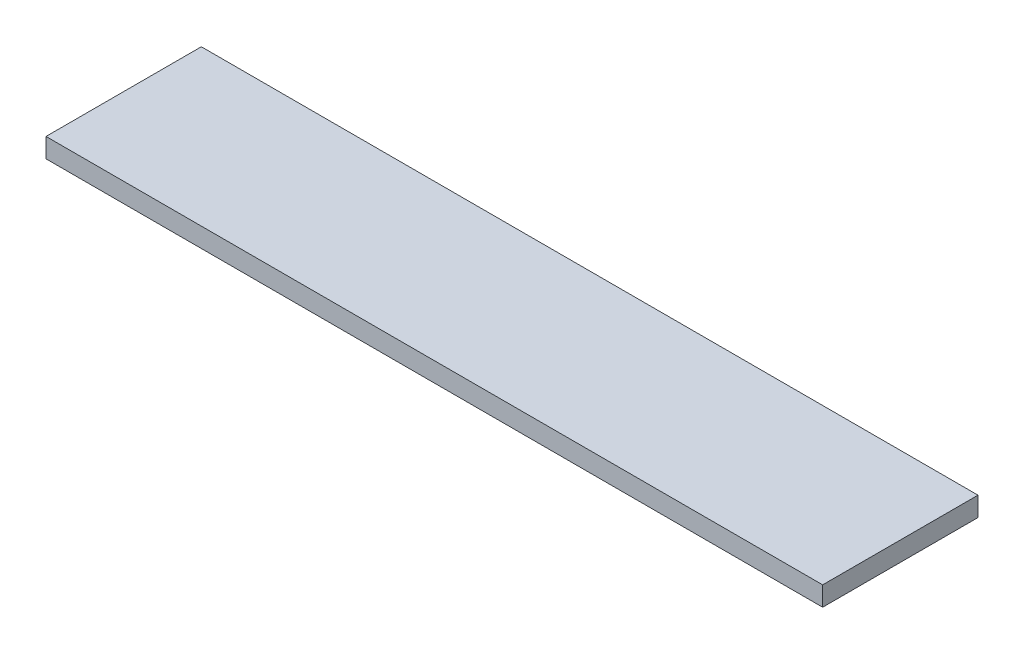
ISO-10303-21;
HEADER;
FILE_DESCRIPTION(('STEP AP214'),'2;1');
FILE_NAME('part.step','',(''),(''),'','','');
FILE_SCHEMA(('AUTOMOTIVE_DESIGN { 1 0 10303 214 1 1 1 1 }'));
ENDSEC;
DATA;
#1=APPLICATION_CONTEXT('core data for automotive mechanical design processes');
#2=APPLICATION_PROTOCOL_DEFINITION('international standard','automotive_design',2000,#1);
#3=PRODUCT_CONTEXT('',#1,'mechanical');
#4=PRODUCT('Part','Part','',(#3));
#5=PRODUCT_RELATED_PRODUCT_CATEGORY('part','',(#4));
#6=PRODUCT_DEFINITION_FORMATION('','',#4);
#7=PRODUCT_DEFINITION_CONTEXT('part definition',#1,'design');
#8=PRODUCT_DEFINITION('design','',#6,#7);
#9=PRODUCT_DEFINITION_SHAPE('','',#8);
#10=(LENGTH_UNIT() NAMED_UNIT(*) SI_UNIT(.MILLI.,.METRE.));
#11=(NAMED_UNIT(*) PLANE_ANGLE_UNIT() SI_UNIT($,.RADIAN.));
#12=(NAMED_UNIT(*) SI_UNIT($,.STERADIAN.) SOLID_ANGLE_UNIT());
#13=UNCERTAINTY_MEASURE_WITH_UNIT(LENGTH_MEASURE(1.E-05),#10,'distance_accuracy_value','');
#14=(GEOMETRIC_REPRESENTATION_CONTEXT(3) GLOBAL_UNCERTAINTY_ASSIGNED_CONTEXT((#13)) GLOBAL_UNIT_ASSIGNED_CONTEXT((#10,
#11,#12)) REPRESENTATION_CONTEXT('',''));
#15=CARTESIAN_POINT('',(0.,0.,0.));
#16=DIRECTION('',(0.,0.,1.));
#17=DIRECTION('',(1.,0.,0.));
#18=AXIS2_PLACEMENT_3D('',#15,#16,#17);
#19=CARTESIAN_POINT('',(0.,6.35,0.));
#20=DIRECTION('',(1.,0.,0.));
#21=DIRECTION('',(0.,0.,-1.));
#22=AXIS2_PLACEMENT_3D('',#19,#20,#21);
#23=PLANE('',#22);
#24=DIRECTION('',(0.,0.,1.));
#25=VECTOR('',#24,1.);
#26=CARTESIAN_POINT('',(0.,0.,0.));
#27=LINE('',#26,#25);
#28=CARTESIAN_POINT('',(0.,0.,-50.8));
#29=VERTEX_POINT('',#28);
#30=CARTESIAN_POINT('',(0.,0.,0.));
#31=VERTEX_POINT('',#30);
#32=EDGE_CURVE('E107',#29,#31,#27,.T.);
#33=ORIENTED_EDGE('',*,*,#32,.T.);
#34=DIRECTION('',(0.,-1.,0.));
#35=VECTOR('',#34,1.);
#36=CARTESIAN_POINT('',(0.,6.35,0.));
#37=LINE('',#36,#35);
#38=CARTESIAN_POINT('',(0.,6.35,0.));
#39=VERTEX_POINT('',#38);
#40=EDGE_CURVE('E11',#39,#31,#37,.T.);
#41=ORIENTED_EDGE('',*,*,#40,.F.);
#42=DIRECTION('',(0.,0.,1.));
#43=VECTOR('',#42,1.);
#44=CARTESIAN_POINT('',(0.,6.35,0.));
#45=LINE('',#44,#43);
#46=CARTESIAN_POINT('',(0.,6.35,-50.8));
#47=VERTEX_POINT('',#46);
#48=EDGE_CURVE('E91',#47,#39,#45,.T.);
#49=ORIENTED_EDGE('',*,*,#48,.F.);
#50=DIRECTION('',(0.,-1.,0.));
#51=VECTOR('',#50,1.);
#52=CARTESIAN_POINT('',(0.,6.35,-50.8));
#53=LINE('',#52,#51);
#54=EDGE_CURVE('E103',#47,#29,#53,.T.);
#55=ORIENTED_EDGE('',*,*,#54,.T.);
#56=EDGE_LOOP('',(#33,#41,#49,#55));
#57=FACE_BOUND('',#56,.T.);
#58=ADVANCED_FACE('F39',(#57),#23,.F.);
#59=CARTESIAN_POINT('',(0.,6.35,0.));
#60=DIRECTION('',(0.,0.,-1.));
#61=DIRECTION('',(-1.,0.,0.));
#62=AXIS2_PLACEMENT_3D('',#59,#60,#61);
#63=PLANE('',#62);
#64=DIRECTION('',(1.,0.,0.));
#65=VECTOR('',#64,1.);
#66=CARTESIAN_POINT('',(0.,0.,0.));
#67=LINE('',#66,#65);
#68=CARTESIAN_POINT('',(254.,0.,0.));
#69=VERTEX_POINT('',#68);
#70=EDGE_CURVE('E96',#31,#69,#67,.T.);
#71=ORIENTED_EDGE('',*,*,#70,.T.);
#72=DIRECTION('',(0.,-1.,0.));
#73=VECTOR('',#72,1.);
#74=CARTESIAN_POINT('',(254.,6.35,0.));
#75=LINE('',#74,#73);
#76=CARTESIAN_POINT('',(254.,6.35,0.));
#77=VERTEX_POINT('',#76);
#78=EDGE_CURVE('E48',#77,#69,#75,.T.);
#79=ORIENTED_EDGE('',*,*,#78,.F.);
#80=DIRECTION('',(1.,0.,0.));
#81=VECTOR('',#80,1.);
#82=CARTESIAN_POINT('',(0.,6.35,0.));
#83=LINE('',#82,#81);
#84=EDGE_CURVE('E86',#39,#77,#83,.T.);
#85=ORIENTED_EDGE('',*,*,#84,.F.);
#86=ORIENTED_EDGE('',*,*,#40,.T.);
#87=EDGE_LOOP('',(#71,#79,#85,#86));
#88=FACE_BOUND('',#87,.T.);
#89=ADVANCED_FACE('F95',(#88),#63,.F.);
#90=CARTESIAN_POINT('',(254.,6.35,0.));
#91=DIRECTION('',(-1.,0.,0.));
#92=DIRECTION('',(0.,0.,1.));
#93=AXIS2_PLACEMENT_3D('',#90,#91,#92);
#94=PLANE('',#93);
#95=DIRECTION('',(0.,0.,-1.));
#96=VECTOR('',#95,1.);
#97=CARTESIAN_POINT('',(254.,0.,0.));
#98=LINE('',#97,#96);
#99=CARTESIAN_POINT('',(254.,0.,-50.8));
#100=VERTEX_POINT('',#99);
#101=EDGE_CURVE('E73',#69,#100,#98,.T.);
#102=ORIENTED_EDGE('',*,*,#101,.T.);
#103=DIRECTION('',(0.,-1.,0.));
#104=VECTOR('',#103,1.);
#105=CARTESIAN_POINT('',(254.,6.35,-50.8));
#106=LINE('',#105,#104);
#107=CARTESIAN_POINT('',(254.,6.35,-50.8));
#108=VERTEX_POINT('',#107);
#109=EDGE_CURVE('E98',#108,#100,#106,.T.);
#110=ORIENTED_EDGE('',*,*,#109,.F.);
#111=DIRECTION('',(0.,0.,-1.));
#112=VECTOR('',#111,1.);
#113=CARTESIAN_POINT('',(254.,6.35,0.));
#114=LINE('',#113,#112);
#115=EDGE_CURVE('E89',#77,#108,#114,.T.);
#116=ORIENTED_EDGE('',*,*,#115,.F.);
#117=ORIENTED_EDGE('',*,*,#78,.T.);
#118=EDGE_LOOP('',(#102,#110,#116,#117));
#119=FACE_BOUND('',#118,.T.);
#120=ADVANCED_FACE('F99',(#119),#94,.F.);
#121=CARTESIAN_POINT('',(0.,6.35,-50.8));
#122=DIRECTION('',(0.,0.,1.));
#123=DIRECTION('',(1.,0.,0.));
#124=AXIS2_PLACEMENT_3D('',#121,#122,#123);
#125=PLANE('',#124);
#126=DIRECTION('',(-1.,0.,0.));
#127=VECTOR('',#126,1.);
#128=CARTESIAN_POINT('',(0.,0.,-50.8));
#129=LINE('',#128,#127);
#130=EDGE_CURVE('E79',#100,#29,#129,.T.);
#131=ORIENTED_EDGE('',*,*,#130,.T.);
#132=ORIENTED_EDGE('',*,*,#54,.F.);
#133=DIRECTION('',(-1.,0.,0.));
#134=VECTOR('',#133,1.);
#135=CARTESIAN_POINT('',(0.,6.35,-50.8));
#136=LINE('',#135,#134);
#137=EDGE_CURVE('E56',#108,#47,#136,.T.);
#138=ORIENTED_EDGE('',*,*,#137,.F.);
#139=ORIENTED_EDGE('',*,*,#109,.T.);
#140=EDGE_LOOP('',(#131,#132,#138,#139));
#141=FACE_BOUND('',#140,.T.);
#142=ADVANCED_FACE('F120',(#141),#125,.F.);
#143=CARTESIAN_POINT('',(0.,6.35,0.));
#144=DIRECTION('',(0.,-1.,0.));
#145=DIRECTION('',(0.,0.,-1.));
#146=AXIS2_PLACEMENT_3D('',#143,#144,#145);
#147=PLANE('',#146);
#148=ORIENTED_EDGE('',*,*,#48,.T.);
#149=ORIENTED_EDGE('',*,*,#84,.T.);
#150=ORIENTED_EDGE('',*,*,#115,.T.);
#151=ORIENTED_EDGE('',*,*,#137,.T.);
#152=EDGE_LOOP('',(#148,#149,#150,#151));
#153=FACE_BOUND('',#152,.T.);
#154=ADVANCED_FACE('F87',(#153),#147,.F.);
#155=CARTESIAN_POINT('',(0.,0.,0.));
#156=DIRECTION('',(0.,-1.,0.));
#157=DIRECTION('',(0.,0.,-1.));
#158=AXIS2_PLACEMENT_3D('',#155,#156,#157);
#159=PLANE('',#158);
#160=ORIENTED_EDGE('',*,*,#32,.F.);
#161=ORIENTED_EDGE('',*,*,#130,.F.);
#162=ORIENTED_EDGE('',*,*,#101,.F.);
#163=ORIENTED_EDGE('',*,*,#70,.F.);
#164=EDGE_LOOP('',(#160,#161,#162,#163));
#165=FACE_BOUND('',#164,.T.);
#166=ADVANCED_FACE('F123',(#165),#159,.T.);
#167=CLOSED_SHELL('',(#58,#89,#120,#142,#154,#166));
#168=MANIFOLD_SOLID_BREP('B2',#167);
#169=ADVANCED_BREP_SHAPE_REPRESENTATION('',(#18,#168),#14);
#170=SHAPE_DEFINITION_REPRESENTATION(#9,#169);
ENDSEC;
END-ISO-10303-21;
